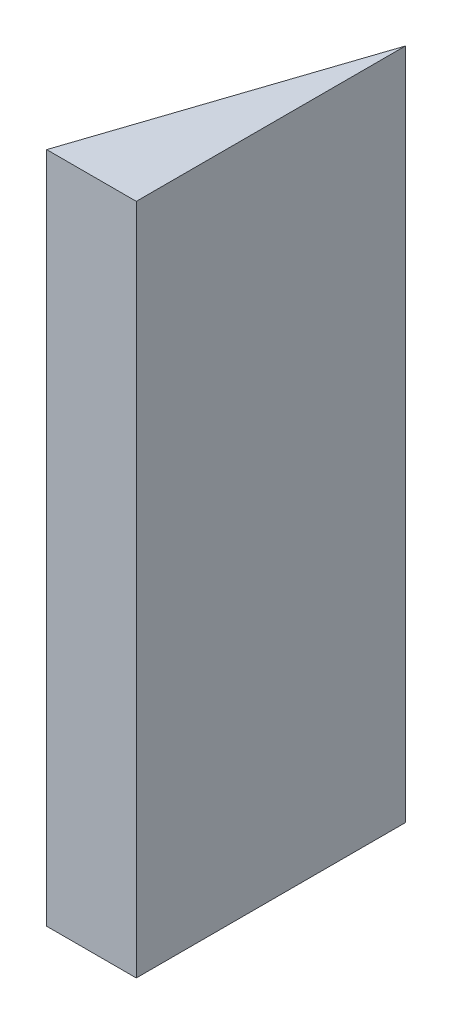
ISO-10303-21;
HEADER;
FILE_DESCRIPTION(('STEP AP214'),'2;1');
FILE_NAME('part.step','',(''),(''),'','','');
FILE_SCHEMA(('AUTOMOTIVE_DESIGN { 1 0 10303 214 1 1 1 1 }'));
ENDSEC;
DATA;
#1=APPLICATION_CONTEXT('core data for automotive mechanical design processes');
#2=APPLICATION_PROTOCOL_DEFINITION('international standard','automotive_design',2000,#1);
#3=PRODUCT_CONTEXT('',#1,'mechanical');
#4=PRODUCT('Part','Part','',(#3));
#5=PRODUCT_RELATED_PRODUCT_CATEGORY('part','',(#4));
#6=PRODUCT_DEFINITION_FORMATION('','',#4);
#7=PRODUCT_DEFINITION_CONTEXT('part definition',#1,'design');
#8=PRODUCT_DEFINITION('design','',#6,#7);
#9=PRODUCT_DEFINITION_SHAPE('','',#8);
#10=(LENGTH_UNIT() NAMED_UNIT(*) SI_UNIT(.MILLI.,.METRE.));
#11=(NAMED_UNIT(*) PLANE_ANGLE_UNIT() SI_UNIT($,.RADIAN.));
#12=(NAMED_UNIT(*) SI_UNIT($,.STERADIAN.) SOLID_ANGLE_UNIT());
#13=UNCERTAINTY_MEASURE_WITH_UNIT(LENGTH_MEASURE(1.E-05),#10,'distance_accuracy_value','');
#14=(GEOMETRIC_REPRESENTATION_CONTEXT(3) GLOBAL_UNCERTAINTY_ASSIGNED_CONTEXT((#13)) GLOBAL_UNIT_ASSIGNED_CONTEXT((#10,
#11,#12)) REPRESENTATION_CONTEXT('',''));
#15=CARTESIAN_POINT('',(0.,0.,0.));
#16=DIRECTION('',(0.,0.,1.));
#17=DIRECTION('',(1.,0.,0.));
#18=AXIS2_PLACEMENT_3D('',#15,#16,#17);
#19=CARTESIAN_POINT('',(3.9199998688658,-0.750000867232944,-3.67112158656318));
#20=DIRECTION('',(1.74845553146952E-07,1.,8.74227765734759E-08));
#21=DIRECTION('',(-1.,1.74845553146952E-07,0.));
#22=AXIS2_PLACEMENT_3D('',#19,#20,#21);
#23=PLANE('',#22);
#24=DIRECTION('',(-0.315990463967219,-2.76939130166601E-08,0.948762365759615));
#25=VECTOR('',#24,1.);
#26=CARTESIAN_POINT('',(3.8999998688658,-0.750000865484488,-3.65112158656318));
#27=LINE('',#26,#25);
#28=CARTESIAN_POINT('',(3.8999998688658,-0.750000865486488,-3.65112158656318));
#29=VERTEX_POINT('',#28);
#30=CARTESIAN_POINT('',(3.7667776942218,-0.750000877162294,-3.25112158656318));
#31=VERTEX_POINT('',#30);
#32=EDGE_CURVE('E11',#29,#31,#27,.T.);
#33=ORIENTED_EDGE('',*,*,#32,.T.);
#34=DIRECTION('',(0.999999999999985,-1.74845553322982E-07,0.));
#35=VECTOR('',#34,1.);
#36=CARTESIAN_POINT('',(3.7667776942218,-0.750000877160294,-3.25112158656318));
#37=LINE('',#36,#35);
#38=CARTESIAN_POINT('',(3.8999998688658,-0.750000900455599,-3.25112158656318));
#39=VERTEX_POINT('',#38);
#40=EDGE_CURVE('E49',#31,#39,#37,.T.);
#41=ORIENTED_EDGE('',*,*,#40,.T.);
#42=DIRECTION('',(0.,8.74227767955201E-08,-0.999999999999996));
#43=VECTOR('',#42,1.);
#44=CARTESIAN_POINT('',(3.8999998688658,-0.750000900453599,-3.25112158656318));
#45=LINE('',#44,#43);
#46=EDGE_CURVE('E47',#39,#29,#45,.T.);
#47=ORIENTED_EDGE('',*,*,#46,.T.);
#48=EDGE_LOOP('',(#33,#41,#47));
#49=FACE_BOUND('',#48,.T.);
#50=ADVANCED_FACE('F17',(#49),#23,.T.);
#51=CARTESIAN_POINT('',(3.91999969402025,-1.75000086723394,-3.67112167398595));
#52=DIRECTION('',(1.74845553146952E-07,1.,8.74227765734759E-08));
#53=DIRECTION('',(-1.,1.74845553146952E-07,0.));
#54=AXIS2_PLACEMENT_3D('',#51,#52,#53);
#55=PLANE('',#54);
#56=DIRECTION('',(0.,8.74227767955201E-08,-0.999999999999996));
#57=VECTOR('',#56,1.);
#58=CARTESIAN_POINT('',(3.89999969402024,-1.7500009004546,-3.25112167398595));
#59=LINE('',#58,#57);
#60=CARTESIAN_POINT('',(3.89999969402024,-1.7500009004536,-3.25112167398595));
#61=VERTEX_POINT('',#60);
#62=CARTESIAN_POINT('',(3.89999969402025,-1.75000086548449,-3.65112167398595));
#63=VERTEX_POINT('',#62);
#64=EDGE_CURVE('E24',#61,#63,#59,.T.);
#65=ORIENTED_EDGE('',*,*,#64,.F.);
#66=DIRECTION('',(0.999999999999985,-1.74845553322981E-07,0.));
#67=VECTOR('',#66,1.);
#68=CARTESIAN_POINT('',(3.76677751937624,-1.75000087716129,-3.25112167398595));
#69=LINE('',#68,#67);
#70=CARTESIAN_POINT('',(3.76677751937624,-1.75000087716029,-3.25112167398595));
#71=VERTEX_POINT('',#70);
#72=EDGE_CURVE('E53',#71,#61,#69,.T.);
#73=ORIENTED_EDGE('',*,*,#72,.F.);
#74=DIRECTION('',(-0.31599046396722,-2.76939124899912E-08,0.948762365759614));
#75=VECTOR('',#74,1.);
#76=CARTESIAN_POINT('',(3.89999969402025,-1.75000086548549,-3.65112167398595));
#77=LINE('',#76,#75);
#78=EDGE_CURVE('E68',#63,#71,#77,.T.);
#79=ORIENTED_EDGE('',*,*,#78,.F.);
#80=EDGE_LOOP('',(#65,#73,#79));
#81=FACE_BOUND('',#80,.T.);
#82=ADVANCED_FACE('F73',(#81),#55,.F.);
#83=CARTESIAN_POINT('',(3.8999998688658,-0.750000865484488,-3.65112158656318));
#84=DIRECTION('',(0.948762365759614,-1.93511644403339E-07,0.315990463967207));
#85=DIRECTION('',(-0.315990463967221,-2.76939128616174E-08,0.948762365759619));
#86=AXIS2_PLACEMENT_3D('',#83,#84,#85);
#87=PLANE('',#86);
#88=DIRECTION('',(-1.74845553146774E-07,-0.999999999999981,-8.74227765733868E-08));
#89=VECTOR('',#88,1.);
#90=CARTESIAN_POINT('',(3.8999998688658,-0.750000865484488,-3.65112158656318));
#91=LINE('',#90,#89);
#92=EDGE_CURVE('E59',#29,#63,#91,.T.);
#93=ORIENTED_EDGE('',*,*,#92,.T.);
#94=ORIENTED_EDGE('',*,*,#78,.T.);
#95=DIRECTION('',(-1.74845553146774E-07,-0.999999999999981,-8.74227765733868E-08));
#96=VECTOR('',#95,1.);
#97=CARTESIAN_POINT('',(3.7667776942218,-0.750000877160294,-3.25112158656318));
#98=LINE('',#97,#96);
#99=EDGE_CURVE('E54',#31,#71,#98,.T.);
#100=ORIENTED_EDGE('',*,*,#99,.F.);
#101=ORIENTED_EDGE('',*,*,#32,.F.);
#102=EDGE_LOOP('',(#93,#94,#100,#101));
#103=FACE_BOUND('',#102,.T.);
#104=ADVANCED_FACE('F57',(#103),#87,.F.);
#105=CARTESIAN_POINT('',(3.7667776942218,-0.750000877160294,-3.25112158656318));
#106=DIRECTION('',(0.,8.74227765734759E-08,-1.));
#107=DIRECTION('',(1.,-1.74845553146952E-07,0.));
#108=AXIS2_PLACEMENT_3D('',#105,#106,#107);
#109=PLANE('',#108);
#110=ORIENTED_EDGE('',*,*,#99,.T.);
#111=ORIENTED_EDGE('',*,*,#72,.T.);
#112=DIRECTION('',(-1.74845553146773E-07,-0.999999999999981,-8.74227765733867E-08));
#113=VECTOR('',#112,1.);
#114=CARTESIAN_POINT('',(3.8999998688658,-0.750000900453599,-3.25112158656318));
#115=LINE('',#114,#113);
#116=EDGE_CURVE('E70',#39,#61,#115,.T.);
#117=ORIENTED_EDGE('',*,*,#116,.F.);
#118=ORIENTED_EDGE('',*,*,#40,.F.);
#119=EDGE_LOOP('',(#110,#111,#117,#118));
#120=FACE_BOUND('',#119,.T.);
#121=ADVANCED_FACE('F72',(#120),#109,.F.);
#122=CARTESIAN_POINT('',(3.8999998688658,-0.750000900453599,-3.25112158656318));
#123=DIRECTION('',(-1.,1.74845553146952E-07,0.));
#124=DIRECTION('',(0.,8.74227765734759E-08,-1.));
#125=AXIS2_PLACEMENT_3D('',#122,#123,#124);
#126=PLANE('',#125);
#127=ORIENTED_EDGE('',*,*,#116,.T.);
#128=ORIENTED_EDGE('',*,*,#64,.T.);
#129=ORIENTED_EDGE('',*,*,#92,.F.);
#130=ORIENTED_EDGE('',*,*,#46,.F.);
#131=EDGE_LOOP('',(#127,#128,#129,#130));
#132=FACE_BOUND('',#131,.T.);
#133=ADVANCED_FACE('F61',(#132),#126,.F.);
#134=CLOSED_SHELL('',(#50,#82,#104,#121,#133));
#135=MANIFOLD_SOLID_BREP('B1',#134);
#136=ADVANCED_BREP_SHAPE_REPRESENTATION('',(#18,#135),#14);
#137=SHAPE_DEFINITION_REPRESENTATION(#9,#136);
ENDSEC;
END-ISO-10303-21;
